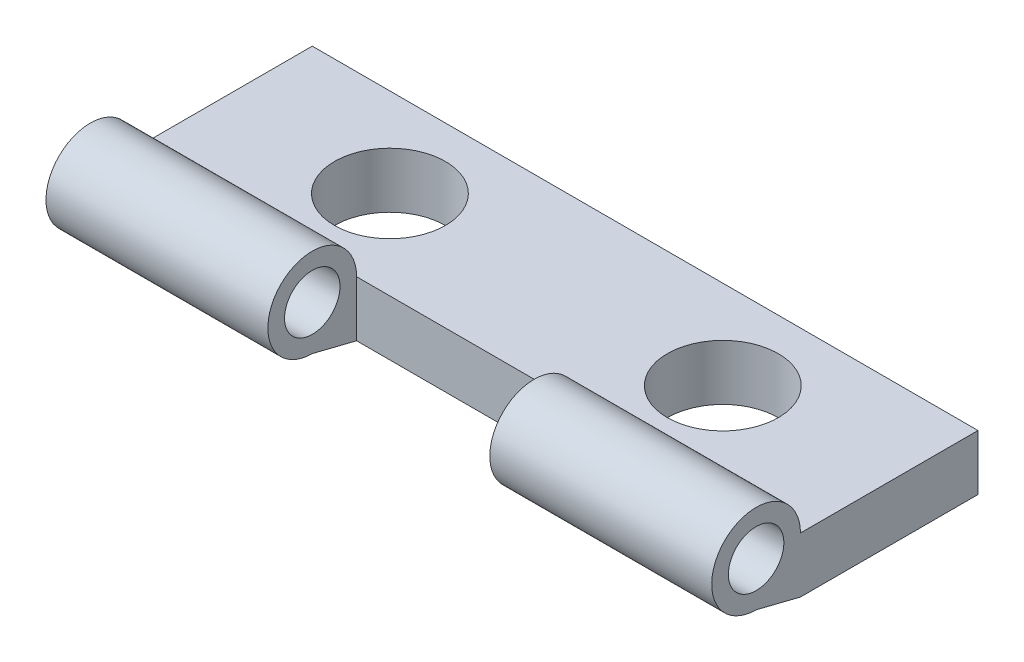
ISO-10303-21;
HEADER;
FILE_DESCRIPTION(('STEP AP214'),'2;1');
FILE_NAME('part.step','',(''),(''),'','','');
FILE_SCHEMA(('AUTOMOTIVE_DESIGN { 1 0 10303 214 1 1 1 1 }'));
ENDSEC;
DATA;
#1=APPLICATION_CONTEXT('core data for automotive mechanical design processes');
#2=APPLICATION_PROTOCOL_DEFINITION('international standard','automotive_design',2000,#1);
#3=PRODUCT_CONTEXT('',#1,'mechanical');
#4=PRODUCT('Part','Part','',(#3));
#5=PRODUCT_RELATED_PRODUCT_CATEGORY('part','',(#4));
#6=PRODUCT_DEFINITION_FORMATION('','',#4);
#7=PRODUCT_DEFINITION_CONTEXT('part definition',#1,'design');
#8=PRODUCT_DEFINITION('design','',#6,#7);
#9=PRODUCT_DEFINITION_SHAPE('','',#8);
#10=(LENGTH_UNIT() NAMED_UNIT(*) SI_UNIT(.MILLI.,.METRE.));
#11=(NAMED_UNIT(*) PLANE_ANGLE_UNIT() SI_UNIT($,.RADIAN.));
#12=(NAMED_UNIT(*) SI_UNIT($,.STERADIAN.) SOLID_ANGLE_UNIT());
#13=UNCERTAINTY_MEASURE_WITH_UNIT(LENGTH_MEASURE(1.E-05),#10,'distance_accuracy_value','');
#14=(GEOMETRIC_REPRESENTATION_CONTEXT(3) GLOBAL_UNCERTAINTY_ASSIGNED_CONTEXT((#13)) GLOBAL_UNIT_ASSIGNED_CONTEXT((#10,
#11,#12)) REPRESENTATION_CONTEXT('',''));
#15=CARTESIAN_POINT('',(0.,0.,0.));
#16=DIRECTION('',(0.,0.,1.));
#17=DIRECTION('',(1.,0.,0.));
#18=AXIS2_PLACEMENT_3D('',#15,#16,#17);
#19=CARTESIAN_POINT('',(21.0207972893961,2.5,6.));
#20=DIRECTION('',(-1.,0.,0.));
#21=DIRECTION('',(0.,0.,1.));
#22=AXIS2_PLACEMENT_3D('',#19,#20,#21);
#23=CYLINDRICAL_SURFACE('',#22,2.);
#24=CARTESIAN_POINT('',(-5.,2.5,6.));
#25=DIRECTION('',(1.,0.,0.));
#26=DIRECTION('',(0.,0.,-1.));
#27=AXIS2_PLACEMENT_3D('',#24,#25,#26);
#28=CIRCLE('',#27,2.);
#29=CARTESIAN_POINT('',(-5.,2.5,4.));
#30=VERTEX_POINT('',#29);
#31=CARTESIAN_POINT('',(-5.,0.499999999999999,6.));
#32=VERTEX_POINT('',#31);
#33=EDGE_CURVE('E160',#30,#32,#28,.T.);
#34=ORIENTED_EDGE('',*,*,#33,.F.);
#35=DIRECTION('',(1.,0.,0.));
#36=VECTOR('',#35,1.);
#37=CARTESIAN_POINT('',(-15.,2.5,4.));
#38=LINE('',#37,#36);
#39=CARTESIAN_POINT('',(-15.,2.5,4.));
#40=VERTEX_POINT('',#39);
#41=EDGE_CURVE('E151',#40,#30,#38,.T.);
#42=ORIENTED_EDGE('',*,*,#41,.F.);
#43=CARTESIAN_POINT('',(-15.,2.5,6.));
#44=DIRECTION('',(1.,0.,0.));
#45=DIRECTION('',(0.,0.,-1.));
#46=AXIS2_PLACEMENT_3D('',#43,#44,#45);
#47=CIRCLE('',#46,2.);
#48=CARTESIAN_POINT('',(-15.,0.499999999999999,6.));
#49=VERTEX_POINT('',#48);
#50=EDGE_CURVE('E164',#49,#40,#47,.F.);
#51=ORIENTED_EDGE('',*,*,#50,.F.);
#52=DIRECTION('',(-1.,0.,0.));
#53=VECTOR('',#52,1.);
#54=CARTESIAN_POINT('',(21.0207972893961,0.5,6.));
#55=LINE('',#54,#53);
#56=EDGE_CURVE('E176',#32,#49,#55,.T.);
#57=ORIENTED_EDGE('',*,*,#56,.F.);
#58=EDGE_LOOP('',(#34,#42,#51,#57));
#59=FACE_BOUND('',#58,.T.);
#60=ADVANCED_FACE('F40',(#59),#23,.T.);
#61=CARTESIAN_POINT('',(5.,2.5,6.));
#62=DIRECTION('',(-1.,0.,0.));
#63=DIRECTION('',(0.,0.,1.));
#64=AXIS2_PLACEMENT_3D('',#61,#62,#63);
#65=CIRCLE('',#64,2.);
#66=CARTESIAN_POINT('',(5.,0.499999999999999,6.));
#67=VERTEX_POINT('',#66);
#68=CARTESIAN_POINT('',(5.,2.5,4.));
#69=VERTEX_POINT('',#68);
#70=EDGE_CURVE('E123',#67,#69,#65,.T.);
#71=ORIENTED_EDGE('',*,*,#70,.F.);
#72=CARTESIAN_POINT('',(15.,0.499999999999999,6.));
#73=VERTEX_POINT('',#72);
#74=EDGE_CURVE('E133',#73,#67,#55,.T.);
#75=ORIENTED_EDGE('',*,*,#74,.F.);
#76=CARTESIAN_POINT('',(15.,2.5,6.));
#77=DIRECTION('',(-1.,0.,0.));
#78=DIRECTION('',(0.,0.,1.));
#79=AXIS2_PLACEMENT_3D('',#76,#77,#78);
#80=CIRCLE('',#79,2.);
#81=CARTESIAN_POINT('',(15.,2.5,4.));
#82=VERTEX_POINT('',#81);
#83=EDGE_CURVE('E173',#73,#82,#80,.T.);
#84=ORIENTED_EDGE('',*,*,#83,.T.);
#85=EDGE_CURVE('E66',#69,#82,#38,.T.);
#86=ORIENTED_EDGE('',*,*,#85,.F.);
#87=EDGE_LOOP('',(#71,#75,#84,#86));
#88=FACE_BOUND('',#87,.T.);
#89=ADVANCED_FACE('F222',(#88),#23,.T.);
#90=CARTESIAN_POINT('',(21.0207972893961,0.,4.));
#91=DIRECTION('',(0.,0.970142500145332,-0.242535625036333));
#92=DIRECTION('',(0.,0.242535625036333,0.970142500145332));
#93=AXIS2_PLACEMENT_3D('',#90,#91,#92);
#94=PLANE('',#93);
#95=DIRECTION('',(0.,-0.242535625036333,-0.970142500145332));
#96=VECTOR('',#95,1.);
#97=CARTESIAN_POINT('',(-5.,0.,4.00000000000001));
#98=LINE('',#97,#96);
#99=CARTESIAN_POINT('',(-5.,0.,4.));
#100=VERTEX_POINT('',#99);
#101=EDGE_CURVE('E158',#32,#100,#98,.T.);
#102=ORIENTED_EDGE('',*,*,#101,.F.);
#103=ORIENTED_EDGE('',*,*,#56,.T.);
#104=DIRECTION('',(0.,0.242535625036333,0.970142500145332));
#105=VECTOR('',#104,1.);
#106=CARTESIAN_POINT('',(-15.,0.,4.));
#107=LINE('',#106,#105);
#108=CARTESIAN_POINT('',(-15.,0.,4.));
#109=VERTEX_POINT('',#108);
#110=EDGE_CURVE('E165',#109,#49,#107,.T.);
#111=ORIENTED_EDGE('',*,*,#110,.F.);
#112=DIRECTION('',(1.,0.,0.));
#113=VECTOR('',#112,1.);
#114=CARTESIAN_POINT('',(-15.,0.,4.));
#115=LINE('',#114,#113);
#116=EDGE_CURVE('E141',#109,#100,#115,.T.);
#117=ORIENTED_EDGE('',*,*,#116,.T.);
#118=EDGE_LOOP('',(#102,#103,#111,#117));
#119=FACE_BOUND('',#118,.T.);
#120=ADVANCED_FACE('F211',(#119),#94,.F.);
#121=DIRECTION('',(0.,0.242535625036333,0.970142500145332));
#122=VECTOR('',#121,1.);
#123=CARTESIAN_POINT('',(5.,0.,4.));
#124=LINE('',#123,#122);
#125=CARTESIAN_POINT('',(5.,0.,4.));
#126=VERTEX_POINT('',#125);
#127=EDGE_CURVE('E121',#126,#67,#124,.T.);
#128=ORIENTED_EDGE('',*,*,#127,.F.);
#129=CARTESIAN_POINT('',(15.,0.,4.));
#130=VERTEX_POINT('',#129);
#131=EDGE_CURVE('E86',#126,#130,#115,.T.);
#132=ORIENTED_EDGE('',*,*,#131,.T.);
#133=DIRECTION('',(0.,0.242535625036333,0.970142500145332));
#134=VECTOR('',#133,1.);
#135=CARTESIAN_POINT('',(15.,0.,4.));
#136=LINE('',#135,#134);
#137=EDGE_CURVE('E179',#130,#73,#136,.T.);
#138=ORIENTED_EDGE('',*,*,#137,.T.);
#139=ORIENTED_EDGE('',*,*,#74,.T.);
#140=EDGE_LOOP('',(#128,#132,#138,#139));
#141=FACE_BOUND('',#140,.T.);
#142=ADVANCED_FACE('F131',(#141),#94,.F.);
#143=CARTESIAN_POINT('',(21.0207972893961,2.5,6.));
#144=DIRECTION('',(-1.,0.,0.));
#145=DIRECTION('',(0.,0.,1.));
#146=AXIS2_PLACEMENT_3D('',#143,#144,#145);
#147=CYLINDRICAL_SURFACE('',#146,1.25);
#148=CARTESIAN_POINT('',(-15.,2.5,6.));
#149=DIRECTION('',(1.,0.,0.));
#150=DIRECTION('',(0.,0.,-1.));
#151=AXIS2_PLACEMENT_3D('',#148,#149,#150);
#152=CIRCLE('',#151,1.25);
#153=CARTESIAN_POINT('',(-15.,2.5,4.75));
#154=VERTEX_POINT('',#153);
#155=EDGE_CURVE('E168',#154,#154,#152,.F.);
#156=ORIENTED_EDGE('',*,*,#155,.T.);
#157=EDGE_LOOP('',(#156));
#158=FACE_BOUND('',#157,.T.);
#159=CARTESIAN_POINT('',(-5.,2.5,6.));
#160=DIRECTION('',(1.,0.,0.));
#161=DIRECTION('',(0.,0.,-1.));
#162=AXIS2_PLACEMENT_3D('',#159,#160,#161);
#163=CIRCLE('',#162,1.25);
#164=CARTESIAN_POINT('',(-5.,2.5,4.75));
#165=VERTEX_POINT('',#164);
#166=EDGE_CURVE('E44',#165,#165,#163,.T.);
#167=ORIENTED_EDGE('',*,*,#166,.T.);
#168=EDGE_LOOP('',(#167));
#169=FACE_BOUND('',#168,.T.);
#170=ADVANCED_FACE('F232',(#158,#169),#147,.F.);
#171=CARTESIAN_POINT('',(15.,2.5,6.));
#172=DIRECTION('',(-1.,0.,0.));
#173=DIRECTION('',(0.,0.,1.));
#174=AXIS2_PLACEMENT_3D('',#171,#172,#173);
#175=CIRCLE('',#174,1.25);
#176=CARTESIAN_POINT('',(15.,2.5,7.25));
#177=VERTEX_POINT('',#176);
#178=EDGE_CURVE('E175',#177,#177,#175,.T.);
#179=ORIENTED_EDGE('',*,*,#178,.F.);
#180=EDGE_LOOP('',(#179));
#181=FACE_BOUND('',#180,.T.);
#182=CARTESIAN_POINT('',(5.,2.5,6.));
#183=DIRECTION('',(-1.,0.,0.));
#184=DIRECTION('',(0.,0.,1.));
#185=AXIS2_PLACEMENT_3D('',#182,#183,#184);
#186=CIRCLE('',#185,1.25);
#187=CARTESIAN_POINT('',(5.,2.5,7.25));
#188=VERTEX_POINT('',#187);
#189=EDGE_CURVE('E134',#188,#188,#186,.T.);
#190=ORIENTED_EDGE('',*,*,#189,.T.);
#191=EDGE_LOOP('',(#190));
#192=FACE_BOUND('',#191,.T.);
#193=ADVANCED_FACE('F235',(#181,#192),#147,.F.);
#194=CARTESIAN_POINT('',(0.,2.5,0.));
#195=DIRECTION('',(0.,-1.,0.));
#196=DIRECTION('',(0.,0.,-1.));
#197=AXIS2_PLACEMENT_3D('',#194,#195,#196);
#198=PLANE('',#197);
#199=DIRECTION('',(0.,0.,-1.));
#200=VECTOR('',#199,1.);
#201=CARTESIAN_POINT('',(15.,2.5,4.));
#202=LINE('',#201,#200);
#203=CARTESIAN_POINT('',(15.,2.5,-4.));
#204=VERTEX_POINT('',#203);
#205=EDGE_CURVE('E144',#82,#204,#202,.T.);
#206=ORIENTED_EDGE('',*,*,#205,.T.);
#207=DIRECTION('',(-1.,0.,0.));
#208=VECTOR('',#207,1.);
#209=CARTESIAN_POINT('',(-15.,2.5,-4.));
#210=LINE('',#209,#208);
#211=CARTESIAN_POINT('',(-15.,2.5,-4.));
#212=VERTEX_POINT('',#211);
#213=EDGE_CURVE('E93',#204,#212,#210,.T.);
#214=ORIENTED_EDGE('',*,*,#213,.T.);
#215=DIRECTION('',(0.,0.,1.));
#216=VECTOR('',#215,1.);
#217=CARTESIAN_POINT('',(-15.,2.5,4.));
#218=LINE('',#217,#216);
#219=EDGE_CURVE('E197',#212,#40,#218,.T.);
#220=ORIENTED_EDGE('',*,*,#219,.T.);
#221=ORIENTED_EDGE('',*,*,#41,.T.);
#222=DIRECTION('',(-1.,0.,0.));
#223=VECTOR('',#222,1.);
#224=CARTESIAN_POINT('',(21.0207972893961,2.5,4.));
#225=LINE('',#224,#223);
#226=EDGE_CURVE('E162',#69,#30,#225,.T.);
#227=ORIENTED_EDGE('',*,*,#226,.F.);
#228=ORIENTED_EDGE('',*,*,#85,.T.);
#229=EDGE_LOOP('',(#206,#214,#220,#221,#227,#228));
#230=FACE_BOUND('',#229,.T.);
#231=CARTESIAN_POINT('',(-7.5,2.5,0.));
#232=DIRECTION('',(0.,1.,0.));
#233=DIRECTION('',(0.,0.,1.));
#234=AXIS2_PLACEMENT_3D('',#231,#232,#233);
#235=CIRCLE('',#234,2.5);
#236=CARTESIAN_POINT('',(-7.5,2.5,2.5));
#237=VERTEX_POINT('',#236);
#238=EDGE_CURVE('E190',#237,#237,#235,.T.);
#239=ORIENTED_EDGE('',*,*,#238,.F.);
#240=EDGE_LOOP('',(#239));
#241=FACE_BOUND('',#240,.T.);
#242=CARTESIAN_POINT('',(7.5,2.5,0.));
#243=DIRECTION('',(0.,1.,0.));
#244=DIRECTION('',(0.,0.,1.));
#245=AXIS2_PLACEMENT_3D('',#242,#243,#244);
#246=CIRCLE('',#245,2.5);
#247=CARTESIAN_POINT('',(7.5,2.5,2.5));
#248=VERTEX_POINT('',#247);
#249=EDGE_CURVE('E184',#248,#248,#246,.T.);
#250=ORIENTED_EDGE('',*,*,#249,.F.);
#251=EDGE_LOOP('',(#250));
#252=FACE_BOUND('',#251,.T.);
#253=ADVANCED_FACE('F217',(#230,#241,#252),#198,.F.);
#254=CARTESIAN_POINT('',(0.,0.,0.));
#255=DIRECTION('',(0.,-1.,0.));
#256=DIRECTION('',(0.,0.,-1.));
#257=AXIS2_PLACEMENT_3D('',#254,#255,#256);
#258=PLANE('',#257);
#259=CARTESIAN_POINT('',(-7.5,0.,0.));
#260=DIRECTION('',(0.,1.,0.));
#261=DIRECTION('',(0.,0.,1.));
#262=AXIS2_PLACEMENT_3D('',#259,#260,#261);
#263=CIRCLE('',#262,2.5);
#264=CARTESIAN_POINT('',(-7.5,0.,2.5));
#265=VERTEX_POINT('',#264);
#266=EDGE_CURVE('E187',#265,#265,#263,.T.);
#267=ORIENTED_EDGE('',*,*,#266,.T.);
#268=EDGE_LOOP('',(#267));
#269=FACE_BOUND('',#268,.T.);
#270=DIRECTION('',(0.,0.,-1.));
#271=VECTOR('',#270,1.);
#272=CARTESIAN_POINT('',(15.,0.,4.));
#273=LINE('',#272,#271);
#274=CARTESIAN_POINT('',(15.,0.,-4.));
#275=VERTEX_POINT('',#274);
#276=EDGE_CURVE('E139',#130,#275,#273,.T.);
#277=ORIENTED_EDGE('',*,*,#276,.F.);
#278=ORIENTED_EDGE('',*,*,#131,.F.);
#279=DIRECTION('',(-1.,0.,0.));
#280=VECTOR('',#279,1.);
#281=CARTESIAN_POINT('',(5.,0.,4.));
#282=LINE('',#281,#280);
#283=EDGE_CURVE('E124',#126,#100,#282,.T.);
#284=ORIENTED_EDGE('',*,*,#283,.T.);
#285=ORIENTED_EDGE('',*,*,#116,.F.);
#286=DIRECTION('',(0.,0.,1.));
#287=VECTOR('',#286,1.);
#288=CARTESIAN_POINT('',(-15.,0.,4.));
#289=LINE('',#288,#287);
#290=CARTESIAN_POINT('',(-15.,0.,-4.));
#291=VERTEX_POINT('',#290);
#292=EDGE_CURVE('E142',#291,#109,#289,.T.);
#293=ORIENTED_EDGE('',*,*,#292,.F.);
#294=DIRECTION('',(-1.,0.,0.));
#295=VECTOR('',#294,1.);
#296=CARTESIAN_POINT('',(-15.,0.,-4.));
#297=LINE('',#296,#295);
#298=EDGE_CURVE('E146',#275,#291,#297,.T.);
#299=ORIENTED_EDGE('',*,*,#298,.F.);
#300=EDGE_LOOP('',(#277,#278,#284,#285,#293,#299));
#301=FACE_BOUND('',#300,.T.);
#302=CARTESIAN_POINT('',(7.5,0.,0.));
#303=DIRECTION('',(0.,1.,0.));
#304=DIRECTION('',(0.,0.,1.));
#305=AXIS2_PLACEMENT_3D('',#302,#303,#304);
#306=CIRCLE('',#305,2.5);
#307=CARTESIAN_POINT('',(7.5,0.,2.5));
#308=VERTEX_POINT('',#307);
#309=EDGE_CURVE('E183',#308,#308,#306,.T.);
#310=ORIENTED_EDGE('',*,*,#309,.T.);
#311=EDGE_LOOP('',(#310));
#312=FACE_BOUND('',#311,.T.);
#313=ADVANCED_FACE('F136',(#269,#301,#312),#258,.T.);
#314=CARTESIAN_POINT('',(15.,2.5,4.));
#315=DIRECTION('',(-1.,0.,0.));
#316=DIRECTION('',(0.,0.,1.));
#317=AXIS2_PLACEMENT_3D('',#314,#315,#316);
#318=PLANE('',#317);
#319=ORIENTED_EDGE('',*,*,#276,.T.);
#320=DIRECTION('',(0.,-1.,0.));
#321=VECTOR('',#320,1.);
#322=CARTESIAN_POINT('',(15.,2.5,-4.));
#323=LINE('',#322,#321);
#324=EDGE_CURVE('E11',#204,#275,#323,.T.);
#325=ORIENTED_EDGE('',*,*,#324,.F.);
#326=ORIENTED_EDGE('',*,*,#205,.F.);
#327=ORIENTED_EDGE('',*,*,#83,.F.);
#328=ORIENTED_EDGE('',*,*,#137,.F.);
#329=EDGE_LOOP('',(#319,#325,#326,#327,#328));
#330=FACE_BOUND('',#329,.T.);
#331=ORIENTED_EDGE('',*,*,#178,.T.);
#332=EDGE_LOOP('',(#331));
#333=FACE_BOUND('',#332,.T.);
#334=ADVANCED_FACE('F42',(#330,#333),#318,.F.);
#335=CARTESIAN_POINT('',(-15.,2.5,-4.));
#336=DIRECTION('',(0.,0.,1.));
#337=DIRECTION('',(1.,0.,0.));
#338=AXIS2_PLACEMENT_3D('',#335,#336,#337);
#339=PLANE('',#338);
#340=ORIENTED_EDGE('',*,*,#298,.T.);
#341=DIRECTION('',(0.,-1.,0.));
#342=VECTOR('',#341,1.);
#343=CARTESIAN_POINT('',(-15.,2.5,-4.));
#344=LINE('',#343,#342);
#345=EDGE_CURVE('E49',#212,#291,#344,.T.);
#346=ORIENTED_EDGE('',*,*,#345,.F.);
#347=ORIENTED_EDGE('',*,*,#213,.F.);
#348=ORIENTED_EDGE('',*,*,#324,.T.);
#349=EDGE_LOOP('',(#340,#346,#347,#348));
#350=FACE_BOUND('',#349,.T.);
#351=ADVANCED_FACE('F201',(#350),#339,.F.);
#352=CARTESIAN_POINT('',(-15.,2.5,4.));
#353=DIRECTION('',(1.,0.,0.));
#354=DIRECTION('',(0.,0.,-1.));
#355=AXIS2_PLACEMENT_3D('',#352,#353,#354);
#356=PLANE('',#355);
#357=ORIENTED_EDGE('',*,*,#292,.T.);
#358=ORIENTED_EDGE('',*,*,#110,.T.);
#359=ORIENTED_EDGE('',*,*,#50,.T.);
#360=ORIENTED_EDGE('',*,*,#219,.F.);
#361=ORIENTED_EDGE('',*,*,#345,.T.);
#362=EDGE_LOOP('',(#357,#358,#359,#360,#361));
#363=FACE_BOUND('',#362,.T.);
#364=ORIENTED_EDGE('',*,*,#155,.F.);
#365=EDGE_LOOP('',(#364));
#366=FACE_BOUND('',#365,.T.);
#367=ADVANCED_FACE('F206',(#363,#366),#356,.F.);
#368=CARTESIAN_POINT('',(-7.5,2.5,0.));
#369=DIRECTION('',(0.,-1.,0.));
#370=DIRECTION('',(0.,0.,-1.));
#371=AXIS2_PLACEMENT_3D('',#368,#369,#370);
#372=CYLINDRICAL_SURFACE('',#371,2.5);
#373=ORIENTED_EDGE('',*,*,#238,.T.);
#374=EDGE_LOOP('',(#373));
#375=FACE_BOUND('',#374,.T.);
#376=ORIENTED_EDGE('',*,*,#266,.F.);
#377=EDGE_LOOP('',(#376));
#378=FACE_BOUND('',#377,.T.);
#379=ADVANCED_FACE('F240',(#375,#378),#372,.F.);
#380=CARTESIAN_POINT('',(7.5,2.5,0.));
#381=DIRECTION('',(0.,-1.,0.));
#382=DIRECTION('',(0.,0.,-1.));
#383=AXIS2_PLACEMENT_3D('',#380,#381,#382);
#384=CYLINDRICAL_SURFACE('',#383,2.5);
#385=ORIENTED_EDGE('',*,*,#249,.T.);
#386=EDGE_LOOP('',(#385));
#387=FACE_BOUND('',#386,.T.);
#388=ORIENTED_EDGE('',*,*,#309,.F.);
#389=EDGE_LOOP('',(#388));
#390=FACE_BOUND('',#389,.T.);
#391=ADVANCED_FACE('F237',(#387,#390),#384,.F.);
#392=CARTESIAN_POINT('',(5.,4.5,4.));
#393=DIRECTION('',(0.,0.,1.));
#394=DIRECTION('',(1.,0.,0.));
#395=AXIS2_PLACEMENT_3D('',#392,#393,#394);
#396=PLANE('',#395);
#397=ORIENTED_EDGE('',*,*,#226,.T.);
#398=DIRECTION('',(0.,-1.,0.));
#399=VECTOR('',#398,1.);
#400=CARTESIAN_POINT('',(-5.,4.5,4.));
#401=LINE('',#400,#399);
#402=EDGE_CURVE('E57',#30,#100,#401,.T.);
#403=ORIENTED_EDGE('',*,*,#402,.T.);
#404=ORIENTED_EDGE('',*,*,#283,.F.);
#405=DIRECTION('',(0.,-1.,0.));
#406=VECTOR('',#405,1.);
#407=CARTESIAN_POINT('',(5.,4.5,4.));
#408=LINE('',#407,#406);
#409=EDGE_CURVE('E119',#69,#126,#408,.T.);
#410=ORIENTED_EDGE('',*,*,#409,.F.);
#411=EDGE_LOOP('',(#397,#403,#404,#410));
#412=FACE_BOUND('',#411,.T.);
#413=ADVANCED_FACE('F127',(#412),#396,.T.);
#414=CARTESIAN_POINT('',(-5.,4.5,4.));
#415=DIRECTION('',(1.,0.,0.));
#416=DIRECTION('',(0.,0.,-1.));
#417=AXIS2_PLACEMENT_3D('',#414,#415,#416);
#418=PLANE('',#417);
#419=ORIENTED_EDGE('',*,*,#166,.F.);
#420=EDGE_LOOP('',(#419));
#421=FACE_BOUND('',#420,.T.);
#422=ORIENTED_EDGE('',*,*,#33,.T.);
#423=ORIENTED_EDGE('',*,*,#101,.T.);
#424=ORIENTED_EDGE('',*,*,#402,.F.);
#425=EDGE_LOOP('',(#422,#423,#424));
#426=FACE_BOUND('',#425,.T.);
#427=ADVANCED_FACE('F321',(#421,#426),#418,.T.);
#428=CARTESIAN_POINT('',(5.,4.5,4.));
#429=DIRECTION('',(-1.,0.,0.));
#430=DIRECTION('',(0.,0.,1.));
#431=AXIS2_PLACEMENT_3D('',#428,#429,#430);
#432=PLANE('',#431);
#433=ORIENTED_EDGE('',*,*,#189,.F.);
#434=EDGE_LOOP('',(#433));
#435=FACE_BOUND('',#434,.T.);
#436=ORIENTED_EDGE('',*,*,#70,.T.);
#437=ORIENTED_EDGE('',*,*,#409,.T.);
#438=ORIENTED_EDGE('',*,*,#127,.T.);
#439=EDGE_LOOP('',(#436,#437,#438));
#440=FACE_BOUND('',#439,.T.);
#441=ADVANCED_FACE('F120',(#435,#440),#432,.T.);
#442=CLOSED_SHELL('',(#60,#89,#120,#142,#170,#193,#253,#313,#334,#351,#367,#379,#391,#413,#427,#441));
#443=MANIFOLD_SOLID_BREP('B2',#442);
#444=ADVANCED_BREP_SHAPE_REPRESENTATION('',(#18,#443),#14);
#445=SHAPE_DEFINITION_REPRESENTATION(#9,#444);
ENDSEC;
END-ISO-10303-21;
